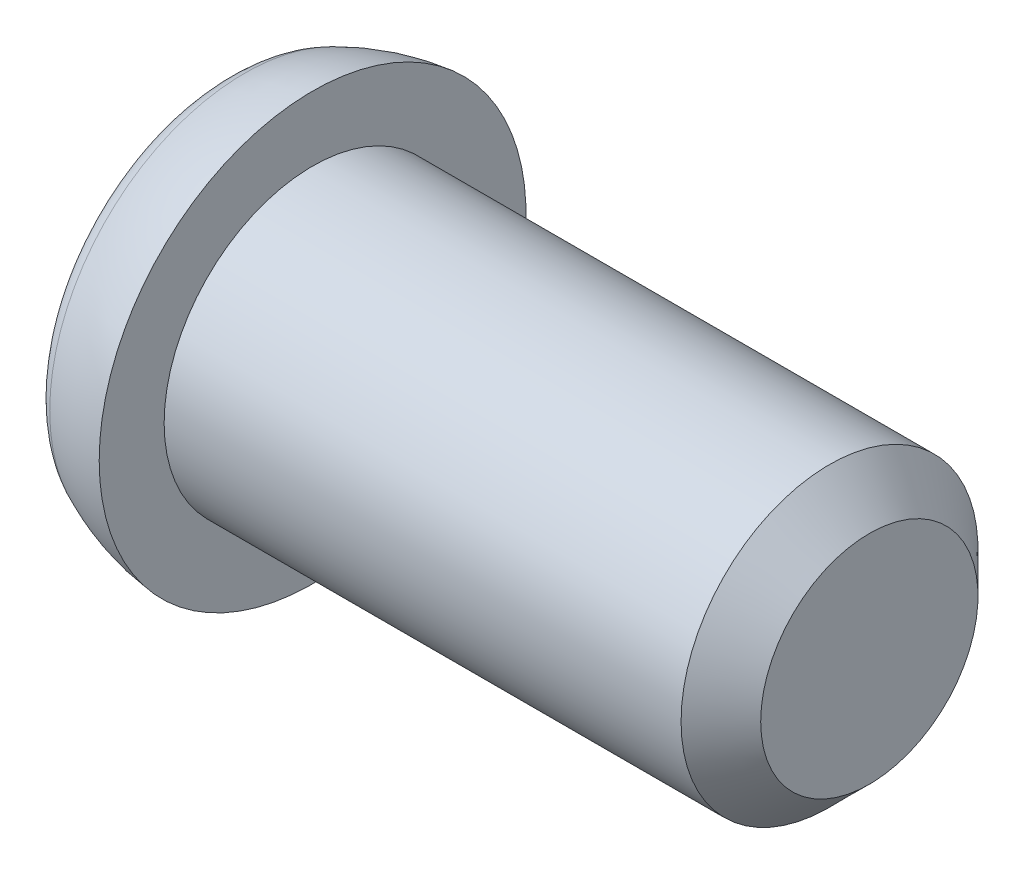
ISO-10303-21;
HEADER;
FILE_DESCRIPTION(('STEP AP214'),'2;1');
FILE_NAME('part.step','',(''),(''),'','','');
FILE_SCHEMA(('AUTOMOTIVE_DESIGN { 1 0 10303 214 1 1 1 1 }'));
ENDSEC;
DATA;
#1=APPLICATION_CONTEXT('core data for automotive mechanical design processes');
#2=APPLICATION_PROTOCOL_DEFINITION('international standard','automotive_design',2000,#1);
#3=PRODUCT_CONTEXT('',#1,'mechanical');
#4=PRODUCT('Part','Part','',(#3));
#5=PRODUCT_RELATED_PRODUCT_CATEGORY('part','',(#4));
#6=PRODUCT_DEFINITION_FORMATION('','',#4);
#7=PRODUCT_DEFINITION_CONTEXT('part definition',#1,'design');
#8=PRODUCT_DEFINITION('design','',#6,#7);
#9=PRODUCT_DEFINITION_SHAPE('','',#8);
#10=(LENGTH_UNIT() NAMED_UNIT(*) SI_UNIT(.MILLI.,.METRE.));
#11=(NAMED_UNIT(*) PLANE_ANGLE_UNIT() SI_UNIT($,.RADIAN.));
#12=(NAMED_UNIT(*) SI_UNIT($,.STERADIAN.) SOLID_ANGLE_UNIT());
#13=UNCERTAINTY_MEASURE_WITH_UNIT(LENGTH_MEASURE(1.E-05),#10,'distance_accuracy_value','');
#14=(GEOMETRIC_REPRESENTATION_CONTEXT(3) GLOBAL_UNCERTAINTY_ASSIGNED_CONTEXT((#13)) GLOBAL_UNIT_ASSIGNED_CONTEXT((#10,
#11,#12)) REPRESENTATION_CONTEXT('',''));
#15=CARTESIAN_POINT('',(0.,0.,0.));
#16=DIRECTION('',(0.,0.,1.));
#17=DIRECTION('',(1.,0.,0.));
#18=AXIS2_PLACEMENT_3D('',#15,#16,#17);
#19=CARTESIAN_POINT('',(-0.658284709925678,0.331281385996479,0.115));
#20=DIRECTION('',(0.,0.,-1.));
#21=DIRECTION('',(-1.,0.,0.));
#22=AXIS2_PLACEMENT_3D('',#19,#20,#21);
#23=CYLINDRICAL_SURFACE('',#22,0.919999999999975);
#24=CARTESIAN_POINT('',(-0.658284709925678,0.331281385996479,0.115));
#25=DIRECTION('',(0.,0.,1.));
#26=DIRECTION('',(1.,0.,0.));
#27=AXIS2_PLACEMENT_3D('',#24,#25,#26);
#28=CIRCLE('',#27,0.919999999999975);
#29=CARTESIAN_POINT('',(-0.5,-0.575,0.115));
#30=VERTEX_POINT('',#29);
#31=CARTESIAN_POINT('',(0.146223167296799,-0.115,0.115));
#32=VERTEX_POINT('',#31);
#33=EDGE_CURVE('E194',#30,#32,#28,.T.);
#34=ORIENTED_EDGE('',*,*,#33,.T.);
#35=DIRECTION('',(0.,0.,-1.));
#36=VECTOR('',#35,1.);
#37=CARTESIAN_POINT('',(0.146223167296799,-0.115,0.115));
#38=LINE('',#37,#36);
#39=CARTESIAN_POINT('',(0.146223167296799,-0.115,-0.115));
#40=VERTEX_POINT('',#39);
#41=EDGE_CURVE('E137',#32,#40,#38,.T.);
#42=ORIENTED_EDGE('',*,*,#41,.T.);
#43=CARTESIAN_POINT('',(-0.658284709925678,0.331281385996479,-0.115));
#44=DIRECTION('',(0.,0.,1.));
#45=DIRECTION('',(1.,0.,0.));
#46=AXIS2_PLACEMENT_3D('',#43,#44,#45);
#47=CIRCLE('',#46,0.919999999999975);
#48=CARTESIAN_POINT('',(-0.5,-0.575,-0.115));
#49=VERTEX_POINT('',#48);
#50=EDGE_CURVE('E183',#49,#40,#47,.T.);
#51=ORIENTED_EDGE('',*,*,#50,.F.);
#52=DIRECTION('',(0.,0.,-1.));
#53=VECTOR('',#52,1.);
#54=CARTESIAN_POINT('',(-0.5,-0.575,0.115));
#55=LINE('',#54,#53);
#56=EDGE_CURVE('E205',#30,#49,#55,.T.);
#57=ORIENTED_EDGE('',*,*,#56,.F.);
#58=EDGE_LOOP('',(#34,#42,#51,#57));
#59=FACE_BOUND('',#58,.T.);
#60=ADVANCED_FACE('F37',(#59),#23,.F.);
#61=CARTESIAN_POINT('',(-0.658284709925678,0.331281385996479,0.115));
#62=DIRECTION('',(0.,0.,1.));
#63=DIRECTION('',(1.,0.,0.));
#64=AXIS2_PLACEMENT_3D('',#61,#62,#63);
#65=PLANE('',#64);
#66=DIRECTION('',(-1.,0.,0.));
#67=VECTOR('',#66,1.);
#68=CARTESIAN_POINT('',(-0.658284709925678,-0.115,0.115));
#69=LINE('',#68,#67);
#70=CARTESIAN_POINT('',(-0.5,-0.115,0.115));
#71=VERTEX_POINT('',#70);
#72=EDGE_CURVE('E166',#32,#71,#69,.T.);
#73=ORIENTED_EDGE('',*,*,#72,.F.);
#74=ORIENTED_EDGE('',*,*,#33,.F.);
#75=DIRECTION('',(0.,-1.,0.));
#76=VECTOR('',#75,1.);
#77=CARTESIAN_POINT('',(-0.5,0.575,0.115));
#78=LINE('',#77,#76);
#79=EDGE_CURVE('E201',#71,#30,#78,.T.);
#80=ORIENTED_EDGE('',*,*,#79,.F.);
#81=EDGE_LOOP('',(#73,#74,#80));
#82=FACE_BOUND('',#81,.T.);
#83=ADVANCED_FACE('F283',(#82),#65,.F.);
#84=CARTESIAN_POINT('',(-0.658284709925678,0.331281385996479,-0.115));
#85=DIRECTION('',(0.,0.,1.));
#86=DIRECTION('',(1.,0.,0.));
#87=AXIS2_PLACEMENT_3D('',#84,#85,#86);
#88=PLANE('',#87);
#89=ORIENTED_EDGE('',*,*,#50,.T.);
#90=DIRECTION('',(-1.,0.,0.));
#91=VECTOR('',#90,1.);
#92=CARTESIAN_POINT('',(-0.658284709925678,-0.115,-0.115));
#93=LINE('',#92,#91);
#94=CARTESIAN_POINT('',(-0.5,-0.115,-0.115));
#95=VERTEX_POINT('',#94);
#96=EDGE_CURVE('E233',#40,#95,#93,.T.);
#97=ORIENTED_EDGE('',*,*,#96,.T.);
#98=DIRECTION('',(0.,-1.,0.));
#99=VECTOR('',#98,1.);
#100=CARTESIAN_POINT('',(-0.5,0.575,-0.115));
#101=LINE('',#100,#99);
#102=EDGE_CURVE('E189',#95,#49,#101,.T.);
#103=ORIENTED_EDGE('',*,*,#102,.T.);
#104=EDGE_LOOP('',(#89,#97,#103));
#105=FACE_BOUND('',#104,.T.);
#106=ADVANCED_FACE('F289',(#105),#88,.T.);
#107=CARTESIAN_POINT('',(-0.5,0.,0.));
#108=DIRECTION('',(1.,0.,0.));
#109=DIRECTION('',(0.,0.,-1.));
#110=AXIS2_PLACEMENT_3D('',#107,#108,#109);
#111=PLANE('',#110);
#112=DIRECTION('',(0.,-1.,0.));
#113=VECTOR('',#112,1.);
#114=CARTESIAN_POINT('',(-0.5,0.115,-0.575));
#115=LINE('',#114,#113);
#116=CARTESIAN_POINT('',(-0.5,0.115,-0.575));
#117=VERTEX_POINT('',#116);
#118=CARTESIAN_POINT('',(-0.5,-0.115,-0.575));
#119=VERTEX_POINT('',#118);
#120=EDGE_CURVE('E128',#117,#119,#115,.T.);
#121=ORIENTED_EDGE('',*,*,#120,.F.);
#122=DIRECTION('',(0.,0.,1.));
#123=VECTOR('',#122,1.);
#124=CARTESIAN_POINT('',(-0.5,0.115,-0.575));
#125=LINE('',#124,#123);
#126=CARTESIAN_POINT('',(-0.5,0.115,-0.115));
#127=VERTEX_POINT('',#126);
#128=EDGE_CURVE('E156',#117,#127,#125,.T.);
#129=ORIENTED_EDGE('',*,*,#128,.T.);
#130=CARTESIAN_POINT('',(-0.5,0.575,-0.115));
#131=VERTEX_POINT('',#130);
#132=EDGE_CURVE('E190',#131,#127,#101,.T.);
#133=ORIENTED_EDGE('',*,*,#132,.F.);
#134=DIRECTION('',(0.,0.,-1.));
#135=VECTOR('',#134,1.);
#136=CARTESIAN_POINT('',(-0.5,0.575,0.115));
#137=LINE('',#136,#135);
#138=CARTESIAN_POINT('',(-0.5,0.575,0.115));
#139=VERTEX_POINT('',#138);
#140=EDGE_CURVE('E208',#139,#131,#137,.T.);
#141=ORIENTED_EDGE('',*,*,#140,.F.);
#142=CARTESIAN_POINT('',(-0.5,0.115,0.115));
#143=VERTEX_POINT('',#142);
#144=EDGE_CURVE('E202',#139,#143,#78,.T.);
#145=ORIENTED_EDGE('',*,*,#144,.T.);
#146=CARTESIAN_POINT('',(-0.5,0.115,0.575));
#147=VERTEX_POINT('',#146);
#148=EDGE_CURVE('E155',#143,#147,#125,.T.);
#149=ORIENTED_EDGE('',*,*,#148,.T.);
#150=DIRECTION('',(0.,-1.,0.));
#151=VECTOR('',#150,1.);
#152=CARTESIAN_POINT('',(-0.5,0.115,0.575));
#153=LINE('',#152,#151);
#154=CARTESIAN_POINT('',(-0.5,-0.115,0.575));
#155=VERTEX_POINT('',#154);
#156=EDGE_CURVE('E159',#147,#155,#153,.T.);
#157=ORIENTED_EDGE('',*,*,#156,.T.);
#158=DIRECTION('',(0.,0.,1.));
#159=VECTOR('',#158,1.);
#160=CARTESIAN_POINT('',(-0.5,-0.115,-0.575));
#161=LINE('',#160,#159);
#162=EDGE_CURVE('E142',#71,#155,#161,.T.);
#163=ORIENTED_EDGE('',*,*,#162,.F.);
#164=ORIENTED_EDGE('',*,*,#79,.T.);
#165=ORIENTED_EDGE('',*,*,#56,.T.);
#166=ORIENTED_EDGE('',*,*,#102,.F.);
#167=EDGE_CURVE('E145',#119,#95,#161,.T.);
#168=ORIENTED_EDGE('',*,*,#167,.F.);
#169=EDGE_LOOP('',(#121,#129,#133,#141,#145,#149,#157,#163,#164,#165,#166,#168));
#170=FACE_BOUND('',#169,.T.);
#171=CARTESIAN_POINT('',(-0.5,0.,0.));
#172=DIRECTION('',(-1.,0.,0.));
#173=DIRECTION('',(0.,0.,1.));
#174=AXIS2_PLACEMENT_3D('',#171,#172,#173);
#175=CIRCLE('',#174,0.84133136956105);
#176=CARTESIAN_POINT('',(-0.5,0.,0.84133136956105));
#177=VERTEX_POINT('',#176);
#178=EDGE_CURVE('E230',#177,#177,#175,.T.);
#179=ORIENTED_EDGE('',*,*,#178,.T.);
#180=EDGE_LOOP('',(#179));
#181=FACE_BOUND('',#180,.T.);
#182=ADVANCED_FACE('F39',(#170,#181),#111,.F.);
#183=CARTESIAN_POINT('',(-0.270000000000117,0.,0.));
#184=DIRECTION('',(-1.,0.,0.));
#185=DIRECTION('',(0.,0.,1.));
#186=AXIS2_PLACEMENT_3D('',#183,#184,#185);
#187=TOROIDAL_SURFACE('',#186,0.841331369561091,0.229999999999883);
#188=ORIENTED_EDGE('',*,*,#178,.F.);
#189=EDGE_LOOP('',(#188));
#190=FACE_BOUND('',#189,.T.);
#191=CARTESIAN_POINT('',(-0.36625121189607,0.,0.));
#192=DIRECTION('',(-1.,0.,0.));
#193=DIRECTION('',(0.,0.,1.));
#194=AXIS2_PLACEMENT_3D('',#191,#192,#193);
#195=CIRCLE('',#194,1.0502229783167);
#196=CARTESIAN_POINT('',(-0.36625121189607,0.,1.0502229783167));
#197=VERTEX_POINT('',#196);
#198=EDGE_CURVE('E227',#197,#197,#195,.T.);
#199=ORIENTED_EDGE('',*,*,#198,.T.);
#200=EDGE_LOOP('',(#199));
#201=FACE_BOUND('',#200,.T.);
#202=ADVANCED_FACE('F358',(#190,#201),#187,.T.);
#203=CARTESIAN_POINT('',(0.115004847584455,0.,0.));
#204=DIRECTION('',(-1.,0.,0.));
#205=DIRECTION('',(0.,0.,1.));
#206=AXIS2_PLACEMENT_3D('',#203,#204,#205);
#207=DEGENERATE_TOROIDAL_SURFACE('',#206,0.00576493453800222,1.15000000000032,.T.);
#208=ORIENTED_EDGE('',*,*,#198,.F.);
#209=EDGE_LOOP('',(#208));
#210=FACE_BOUND('',#209,.T.);
#211=CARTESIAN_POINT('',(0.,0.,0.));
#212=DIRECTION('',(-1.,0.,0.));
#213=DIRECTION('',(0.,0.,1.));
#214=AXIS2_PLACEMENT_3D('',#211,#212,#213);
#215=CIRCLE('',#214,1.15);
#216=CARTESIAN_POINT('',(0.,0.,1.15));
#217=VERTEX_POINT('',#216);
#218=EDGE_CURVE('E224',#217,#217,#215,.T.);
#219=ORIENTED_EDGE('',*,*,#218,.T.);
#220=EDGE_LOOP('',(#219));
#221=FACE_BOUND('',#220,.T.);
#222=ADVANCED_FACE('F362',(#210,#221),#207,.T.);
#223=CARTESIAN_POINT('',(0.,1.15,0.));
#224=DIRECTION('',(-1.,0.,0.));
#225=DIRECTION('',(0.,0.,1.));
#226=AXIS2_PLACEMENT_3D('',#223,#224,#225);
#227=PLANE('',#226);
#228=ORIENTED_EDGE('',*,*,#218,.F.);
#229=EDGE_LOOP('',(#228));
#230=FACE_BOUND('',#229,.T.);
#231=CARTESIAN_POINT('',(0.,0.,0.));
#232=DIRECTION('',(-1.,0.,0.));
#233=DIRECTION('',(0.,0.,1.));
#234=AXIS2_PLACEMENT_3D('',#231,#232,#233);
#235=CIRCLE('',#234,0.8);
#236=CARTESIAN_POINT('',(0.,0.,0.8));
#237=VERTEX_POINT('',#236);
#238=EDGE_CURVE('E221',#237,#237,#235,.T.);
#239=ORIENTED_EDGE('',*,*,#238,.T.);
#240=EDGE_LOOP('',(#239));
#241=FACE_BOUND('',#240,.T.);
#242=ADVANCED_FACE('F367',(#230,#241),#227,.F.);
#243=CARTESIAN_POINT('',(3.,0.,0.));
#244=DIRECTION('',(-1.,0.,0.));
#245=DIRECTION('',(0.,0.,1.));
#246=AXIS2_PLACEMENT_3D('',#243,#244,#245);
#247=CYLINDRICAL_SURFACE('',#246,0.8);
#248=ORIENTED_EDGE('',*,*,#238,.F.);
#249=EDGE_LOOP('',(#248));
#250=FACE_BOUND('',#249,.T.);
#251=CARTESIAN_POINT('',(2.7855,0.,0.));
#252=DIRECTION('',(-1.,0.,0.));
#253=DIRECTION('',(0.,0.,1.));
#254=AXIS2_PLACEMENT_3D('',#251,#252,#253);
#255=CIRCLE('',#254,0.8);
#256=CARTESIAN_POINT('',(2.7855,0.,0.8));
#257=VERTEX_POINT('',#256);
#258=EDGE_CURVE('E218',#257,#257,#255,.T.);
#259=ORIENTED_EDGE('',*,*,#258,.T.);
#260=EDGE_LOOP('',(#259));
#261=FACE_BOUND('',#260,.T.);
#262=ADVANCED_FACE('F375',(#250,#261),#247,.T.);
#263=CARTESIAN_POINT('',(3.,0.,0.));
#264=DIRECTION('',(-1.,0.,0.));
#265=DIRECTION('',(0.,0.,1.));
#266=AXIS2_PLACEMENT_3D('',#263,#264,#265);
#267=CONICAL_SURFACE('',#266,0.5855,0.785398163397449);
#268=ORIENTED_EDGE('',*,*,#258,.F.);
#269=EDGE_LOOP('',(#268));
#270=FACE_BOUND('',#269,.T.);
#271=CARTESIAN_POINT('',(3.,0.,0.));
#272=DIRECTION('',(-1.,0.,0.));
#273=DIRECTION('',(0.,0.,1.));
#274=AXIS2_PLACEMENT_3D('',#271,#272,#273);
#275=CIRCLE('',#274,0.5855);
#276=CARTESIAN_POINT('',(3.,0.,0.5855));
#277=VERTEX_POINT('',#276);
#278=EDGE_CURVE('E215',#277,#277,#275,.T.);
#279=ORIENTED_EDGE('',*,*,#278,.T.);
#280=EDGE_LOOP('',(#279));
#281=FACE_BOUND('',#280,.T.);
#282=ADVANCED_FACE('F379',(#270,#281),#267,.T.);
#283=CARTESIAN_POINT('',(3.,0.5855,0.));
#284=DIRECTION('',(-1.,0.,0.));
#285=DIRECTION('',(0.,0.,1.));
#286=AXIS2_PLACEMENT_3D('',#283,#284,#285);
#287=PLANE('',#286);
#288=ORIENTED_EDGE('',*,*,#278,.F.);
#289=EDGE_LOOP('',(#288));
#290=FACE_BOUND('',#289,.T.);
#291=ADVANCED_FACE('F339',(#290),#287,.F.);
#292=CARTESIAN_POINT('',(-0.658284709925717,-0.331281385996524,0.115));
#293=DIRECTION('',(0.,0.,-1.));
#294=DIRECTION('',(-1.,0.,0.));
#295=AXIS2_PLACEMENT_3D('',#292,#293,#294);
#296=CYLINDRICAL_SURFACE('',#295,0.920000000000027);
#297=DIRECTION('',(0.,0.,-1.));
#298=VECTOR('',#297,1.);
#299=CARTESIAN_POINT('',(0.146223167296794,0.115,0.115));
#300=LINE('',#299,#298);
#301=CARTESIAN_POINT('',(0.146223167296794,0.115,0.115));
#302=VERTEX_POINT('',#301);
#303=CARTESIAN_POINT('',(0.146223167296794,0.115,-0.115));
#304=VERTEX_POINT('',#303);
#305=EDGE_CURVE('E168',#302,#304,#300,.T.);
#306=ORIENTED_EDGE('',*,*,#305,.F.);
#307=CARTESIAN_POINT('',(-0.658284709925717,-0.331281385996524,0.115));
#308=DIRECTION('',(0.,0.,1.));
#309=DIRECTION('',(1.,0.,0.));
#310=AXIS2_PLACEMENT_3D('',#307,#308,#309);
#311=CIRCLE('',#310,0.920000000000027);
#312=EDGE_CURVE('E197',#302,#139,#311,.T.);
#313=ORIENTED_EDGE('',*,*,#312,.T.);
#314=ORIENTED_EDGE('',*,*,#140,.T.);
#315=CARTESIAN_POINT('',(-0.658284709925717,-0.331281385996524,-0.115));
#316=DIRECTION('',(0.,0.,1.));
#317=DIRECTION('',(1.,0.,0.));
#318=AXIS2_PLACEMENT_3D('',#315,#316,#317);
#319=CIRCLE('',#318,0.920000000000027);
#320=EDGE_CURVE('E185',#304,#131,#319,.T.);
#321=ORIENTED_EDGE('',*,*,#320,.F.);
#322=EDGE_LOOP('',(#306,#313,#314,#321));
#323=FACE_BOUND('',#322,.T.);
#324=ADVANCED_FACE('F251',(#323),#296,.F.);
#325=ORIENTED_EDGE('',*,*,#312,.F.);
#326=DIRECTION('',(-1.,0.,0.));
#327=VECTOR('',#326,1.);
#328=CARTESIAN_POINT('',(-0.658284709925678,0.115,0.115));
#329=LINE('',#328,#327);
#330=EDGE_CURVE('E171',#302,#143,#329,.T.);
#331=ORIENTED_EDGE('',*,*,#330,.T.);
#332=ORIENTED_EDGE('',*,*,#144,.F.);
#333=EDGE_LOOP('',(#325,#331,#332));
#334=FACE_BOUND('',#333,.T.);
#335=ADVANCED_FACE('F255',(#334),#65,.F.);
#336=DIRECTION('',(-1.,0.,0.));
#337=VECTOR('',#336,1.);
#338=CARTESIAN_POINT('',(-0.658284709925678,0.115,-0.115));
#339=LINE('',#338,#337);
#340=EDGE_CURVE('E45',#304,#127,#339,.T.);
#341=ORIENTED_EDGE('',*,*,#340,.F.);
#342=ORIENTED_EDGE('',*,*,#320,.T.);
#343=ORIENTED_EDGE('',*,*,#132,.T.);
#344=EDGE_LOOP('',(#341,#342,#343));
#345=FACE_BOUND('',#344,.T.);
#346=ADVANCED_FACE('F248',(#345),#88,.T.);
#347=CARTESIAN_POINT('',(-0.658284709925678,-0.115,-0.331281385996479));
#348=DIRECTION('',(0.,1.,0.));
#349=DIRECTION('',(0.,0.,1.));
#350=AXIS2_PLACEMENT_3D('',#347,#348,#349);
#351=PLANE('',#350);
#352=CARTESIAN_POINT('',(-0.658284709925717,-0.115,0.331281385996524));
#353=DIRECTION('',(0.,1.,0.));
#354=DIRECTION('',(0.,0.,1.));
#355=AXIS2_PLACEMENT_3D('',#352,#353,#354);
#356=CIRCLE('',#355,0.920000000000027);
#357=EDGE_CURVE('E143',#40,#119,#356,.T.);
#358=ORIENTED_EDGE('',*,*,#357,.T.);
#359=ORIENTED_EDGE('',*,*,#167,.T.);
#360=ORIENTED_EDGE('',*,*,#96,.F.);
#361=EDGE_LOOP('',(#358,#359,#360));
#362=FACE_BOUND('',#361,.T.);
#363=ADVANCED_FACE('F292',(#362),#351,.T.);
#364=CARTESIAN_POINT('',(-0.658284709925678,0.115,-0.331281385996479));
#365=DIRECTION('',(0.,1.,0.));
#366=DIRECTION('',(0.,0.,1.));
#367=AXIS2_PLACEMENT_3D('',#364,#365,#366);
#368=PLANE('',#367);
#369=ORIENTED_EDGE('',*,*,#340,.T.);
#370=ORIENTED_EDGE('',*,*,#128,.F.);
#371=CARTESIAN_POINT('',(-0.658284709925717,0.115,0.331281385996524));
#372=DIRECTION('',(0.,1.,0.));
#373=DIRECTION('',(0.,0.,1.));
#374=AXIS2_PLACEMENT_3D('',#371,#372,#373);
#375=CIRCLE('',#374,0.920000000000027);
#376=EDGE_CURVE('E59',#304,#117,#375,.T.);
#377=ORIENTED_EDGE('',*,*,#376,.F.);
#378=EDGE_LOOP('',(#369,#370,#377));
#379=FACE_BOUND('',#378,.T.);
#380=ADVANCED_FACE('F239',(#379),#368,.F.);
#381=CARTESIAN_POINT('',(-0.658284709925717,0.115,0.331281385996524));
#382=DIRECTION('',(0.,-1.,0.));
#383=DIRECTION('',(0.,0.,-1.));
#384=AXIS2_PLACEMENT_3D('',#381,#382,#383);
#385=CYLINDRICAL_SURFACE('',#384,0.920000000000027);
#386=ORIENTED_EDGE('',*,*,#376,.T.);
#387=ORIENTED_EDGE('',*,*,#120,.T.);
#388=ORIENTED_EDGE('',*,*,#357,.F.);
#389=DIRECTION('',(0.,-1.,0.));
#390=VECTOR('',#389,1.);
#391=CARTESIAN_POINT('',(0.146223167296794,0.115,-0.115));
#392=LINE('',#391,#390);
#393=EDGE_CURVE('E236',#304,#40,#392,.T.);
#394=ORIENTED_EDGE('',*,*,#393,.F.);
#395=EDGE_LOOP('',(#386,#387,#388,#394));
#396=FACE_BOUND('',#395,.T.);
#397=ADVANCED_FACE('F294',(#396),#385,.F.);
#398=CARTESIAN_POINT('',(0.2,0.,-0.115));
#399=VERTEX_POINT('',#398);
#400=EDGE_CURVE('E186',#399,#304,#319,.T.);
#401=ORIENTED_EDGE('',*,*,#400,.T.);
#402=ORIENTED_EDGE('',*,*,#393,.T.);
#403=EDGE_CURVE('E182',#40,#399,#47,.T.);
#404=ORIENTED_EDGE('',*,*,#403,.T.);
#405=EDGE_LOOP('',(#401,#402,#404));
#406=FACE_BOUND('',#405,.T.);
#407=ADVANCED_FACE('F297',(#406),#88,.T.);
#408=DIRECTION('',(0.,0.,-1.));
#409=VECTOR('',#408,1.);
#410=CARTESIAN_POINT('',(0.2,0.,0.115));
#411=LINE('',#410,#409);
#412=CARTESIAN_POINT('',(0.2,0.,0.));
#413=VERTEX_POINT('',#412);
#414=EDGE_CURVE('E211',#413,#399,#411,.T.);
#415=ORIENTED_EDGE('',*,*,#414,.F.);
#416=CARTESIAN_POINT('',(-0.658284709925717,-0.331281385996524,0.331281385996524));
#417=DIRECTION('',(0.,-0.707106781186547,-0.707106781186547));
#418=DIRECTION('',(0.,0.707106781186547,-0.707106781186547));
#419=AXIS2_PLACEMENT_3D('',#416,#417,#418);
#420=ELLIPSE('',#419,1.30107647738329,0.920000000000027);
#421=EDGE_CURVE('E174',#413,#304,#420,.F.);
#422=ORIENTED_EDGE('',*,*,#421,.T.);
#423=ORIENTED_EDGE('',*,*,#400,.F.);
#424=EDGE_LOOP('',(#415,#422,#423));
#425=FACE_BOUND('',#424,.T.);
#426=ADVANCED_FACE('F301',(#425),#296,.F.);
#427=ORIENTED_EDGE('',*,*,#403,.F.);
#428=CARTESIAN_POINT('',(-0.658284709925697,0.331281385996479,0.331281385996524));
#429=DIRECTION('',(0.,0.707106781186547,-0.707106781186547));
#430=DIRECTION('',(0.,-0.707106781186547,-0.707106781186547));
#431=AXIS2_PLACEMENT_3D('',#428,#429,#430);
#432=ELLIPSE('',#431,1.30107647738325,0.920000000000001);
#433=EDGE_CURVE('E141',#40,#413,#432,.F.);
#434=ORIENTED_EDGE('',*,*,#433,.T.);
#435=ORIENTED_EDGE('',*,*,#414,.T.);
#436=EDGE_LOOP('',(#427,#434,#435));
#437=FACE_BOUND('',#436,.T.);
#438=ADVANCED_FACE('F317',(#437),#23,.F.);
#439=ORIENTED_EDGE('',*,*,#72,.T.);
#440=ORIENTED_EDGE('',*,*,#162,.T.);
#441=CARTESIAN_POINT('',(-0.658284709925678,-0.115,-0.331281385996479));
#442=DIRECTION('',(0.,1.,0.));
#443=DIRECTION('',(0.,0.,1.));
#444=AXIS2_PLACEMENT_3D('',#441,#442,#443);
#445=CIRCLE('',#444,0.919999999999975);
#446=EDGE_CURVE('E52',#155,#32,#445,.T.);
#447=ORIENTED_EDGE('',*,*,#446,.T.);
#448=EDGE_LOOP('',(#439,#440,#447));
#449=FACE_BOUND('',#448,.T.);
#450=ADVANCED_FACE('F327',(#449),#351,.T.);
#451=CARTESIAN_POINT('',(-0.658284709925678,0.115,-0.331281385996479));
#452=DIRECTION('',(0.,1.,0.));
#453=DIRECTION('',(0.,0.,1.));
#454=AXIS2_PLACEMENT_3D('',#451,#452,#453);
#455=CIRCLE('',#454,0.919999999999975);
#456=EDGE_CURVE('E149',#147,#302,#455,.T.);
#457=ORIENTED_EDGE('',*,*,#456,.F.);
#458=ORIENTED_EDGE('',*,*,#148,.F.);
#459=ORIENTED_EDGE('',*,*,#330,.F.);
#460=EDGE_LOOP('',(#457,#458,#459));
#461=FACE_BOUND('',#460,.T.);
#462=ADVANCED_FACE('F260',(#461),#368,.F.);
#463=CARTESIAN_POINT('',(-0.658284709925678,0.115,-0.331281385996479));
#464=DIRECTION('',(0.,-1.,0.));
#465=DIRECTION('',(0.,0.,-1.));
#466=AXIS2_PLACEMENT_3D('',#463,#464,#465);
#467=CYLINDRICAL_SURFACE('',#466,0.919999999999975);
#468=DIRECTION('',(0.,-1.,0.));
#469=VECTOR('',#468,1.);
#470=CARTESIAN_POINT('',(0.146223167296799,0.115,0.115));
#471=LINE('',#470,#469);
#472=EDGE_CURVE('E11',#302,#32,#471,.T.);
#473=ORIENTED_EDGE('',*,*,#472,.T.);
#474=ORIENTED_EDGE('',*,*,#446,.F.);
#475=ORIENTED_EDGE('',*,*,#156,.F.);
#476=ORIENTED_EDGE('',*,*,#456,.T.);
#477=EDGE_LOOP('',(#473,#474,#475,#476));
#478=FACE_BOUND('',#477,.T.);
#479=ADVANCED_FACE('F277',(#478),#467,.F.);
#480=ORIENTED_EDGE('',*,*,#472,.F.);
#481=CARTESIAN_POINT('',(0.2,0.,0.115));
#482=VERTEX_POINT('',#481);
#483=EDGE_CURVE('E198',#482,#302,#311,.T.);
#484=ORIENTED_EDGE('',*,*,#483,.F.);
#485=EDGE_CURVE('E193',#32,#482,#28,.T.);
#486=ORIENTED_EDGE('',*,*,#485,.F.);
#487=EDGE_LOOP('',(#480,#484,#486));
#488=FACE_BOUND('',#487,.T.);
#489=ADVANCED_FACE('F275',(#488),#65,.F.);
#490=ORIENTED_EDGE('',*,*,#483,.T.);
#491=CARTESIAN_POINT('',(-0.658284709925697,-0.331281385996524,-0.331281385996479));
#492=DIRECTION('',(0.,0.707106781186547,-0.707106781186547));
#493=DIRECTION('',(0.,-0.707106781186547,-0.707106781186547));
#494=AXIS2_PLACEMENT_3D('',#491,#492,#493);
#495=ELLIPSE('',#494,1.30107647738325,0.920000000000001);
#496=EDGE_CURVE('E178',#302,#413,#495,.T.);
#497=ORIENTED_EDGE('',*,*,#496,.T.);
#498=EDGE_CURVE('E212',#482,#413,#411,.T.);
#499=ORIENTED_EDGE('',*,*,#498,.F.);
#500=EDGE_LOOP('',(#490,#497,#499));
#501=FACE_BOUND('',#500,.T.);
#502=ADVANCED_FACE('F272',(#501),#296,.F.);
#503=ORIENTED_EDGE('',*,*,#498,.T.);
#504=CARTESIAN_POINT('',(-0.658284709925678,0.331281385996479,-0.331281385996479));
#505=DIRECTION('',(0.,-0.707106781186547,-0.707106781186547));
#506=DIRECTION('',(0.,0.707106781186547,-0.707106781186547));
#507=AXIS2_PLACEMENT_3D('',#504,#505,#506);
#508=ELLIPSE('',#507,1.30107647738321,0.919999999999975);
#509=EDGE_CURVE('E122',#413,#32,#508,.T.);
#510=ORIENTED_EDGE('',*,*,#509,.T.);
#511=ORIENTED_EDGE('',*,*,#485,.T.);
#512=EDGE_LOOP('',(#503,#510,#511));
#513=FACE_BOUND('',#512,.T.);
#514=ADVANCED_FACE('F311',(#513),#23,.F.);
#515=ORIENTED_EDGE('',*,*,#305,.T.);
#516=CARTESIAN_POINT('',(0.2,0.115,0.));
#517=VERTEX_POINT('',#516);
#518=EDGE_CURVE('E152',#517,#304,#375,.T.);
#519=ORIENTED_EDGE('',*,*,#518,.F.);
#520=EDGE_CURVE('E148',#302,#517,#455,.T.);
#521=ORIENTED_EDGE('',*,*,#520,.F.);
#522=EDGE_LOOP('',(#515,#519,#521));
#523=FACE_BOUND('',#522,.T.);
#524=ADVANCED_FACE('F269',(#523),#368,.F.);
#525=DIRECTION('',(0.,-1.,0.));
#526=VECTOR('',#525,1.);
#527=CARTESIAN_POINT('',(0.2,0.115,0.));
#528=LINE('',#527,#526);
#529=EDGE_CURVE('E127',#517,#413,#528,.T.);
#530=ORIENTED_EDGE('',*,*,#529,.F.);
#531=ORIENTED_EDGE('',*,*,#518,.T.);
#532=ORIENTED_EDGE('',*,*,#421,.F.);
#533=EDGE_LOOP('',(#530,#531,#532));
#534=FACE_BOUND('',#533,.T.);
#535=ADVANCED_FACE('F303',(#534),#385,.F.);
#536=ORIENTED_EDGE('',*,*,#520,.T.);
#537=ORIENTED_EDGE('',*,*,#529,.T.);
#538=ORIENTED_EDGE('',*,*,#496,.F.);
#539=EDGE_LOOP('',(#536,#537,#538));
#540=FACE_BOUND('',#539,.T.);
#541=ADVANCED_FACE('F263',(#540),#467,.F.);
#542=CARTESIAN_POINT('',(0.2,-0.115,0.));
#543=VERTEX_POINT('',#542);
#544=EDGE_CURVE('E116',#413,#543,#528,.T.);
#545=ORIENTED_EDGE('',*,*,#544,.T.);
#546=EDGE_CURVE('E119',#32,#543,#445,.T.);
#547=ORIENTED_EDGE('',*,*,#546,.F.);
#548=ORIENTED_EDGE('',*,*,#509,.F.);
#549=EDGE_LOOP('',(#545,#547,#548));
#550=FACE_BOUND('',#549,.T.);
#551=ADVANCED_FACE('F118',(#550),#467,.F.);
#552=EDGE_CURVE('E134',#543,#40,#356,.T.);
#553=ORIENTED_EDGE('',*,*,#552,.F.);
#554=ORIENTED_EDGE('',*,*,#544,.F.);
#555=ORIENTED_EDGE('',*,*,#433,.F.);
#556=EDGE_LOOP('',(#553,#554,#555));
#557=FACE_BOUND('',#556,.T.);
#558=ADVANCED_FACE('F139',(#557),#385,.F.);
#559=ORIENTED_EDGE('',*,*,#546,.T.);
#560=ORIENTED_EDGE('',*,*,#552,.T.);
#561=ORIENTED_EDGE('',*,*,#41,.F.);
#562=EDGE_LOOP('',(#559,#560,#561));
#563=FACE_BOUND('',#562,.T.);
#564=ADVANCED_FACE('F133',(#563),#351,.T.);
#565=CLOSED_SHELL('',(#60,#83,#106,#182,#202,#222,#242,#262,#282,#291,#324,#335,#346,#363,#380,
#397,#407,#426,#438,#450,#462,#479,#489,#502,#514,#524,#535,#541,#551,#558,#564));
#566=MANIFOLD_SOLID_BREP('B2',#565);
#567=ADVANCED_BREP_SHAPE_REPRESENTATION('',(#18,#566),#14);
#568=SHAPE_DEFINITION_REPRESENTATION(#9,#567);
ENDSEC;
END-ISO-10303-21;
